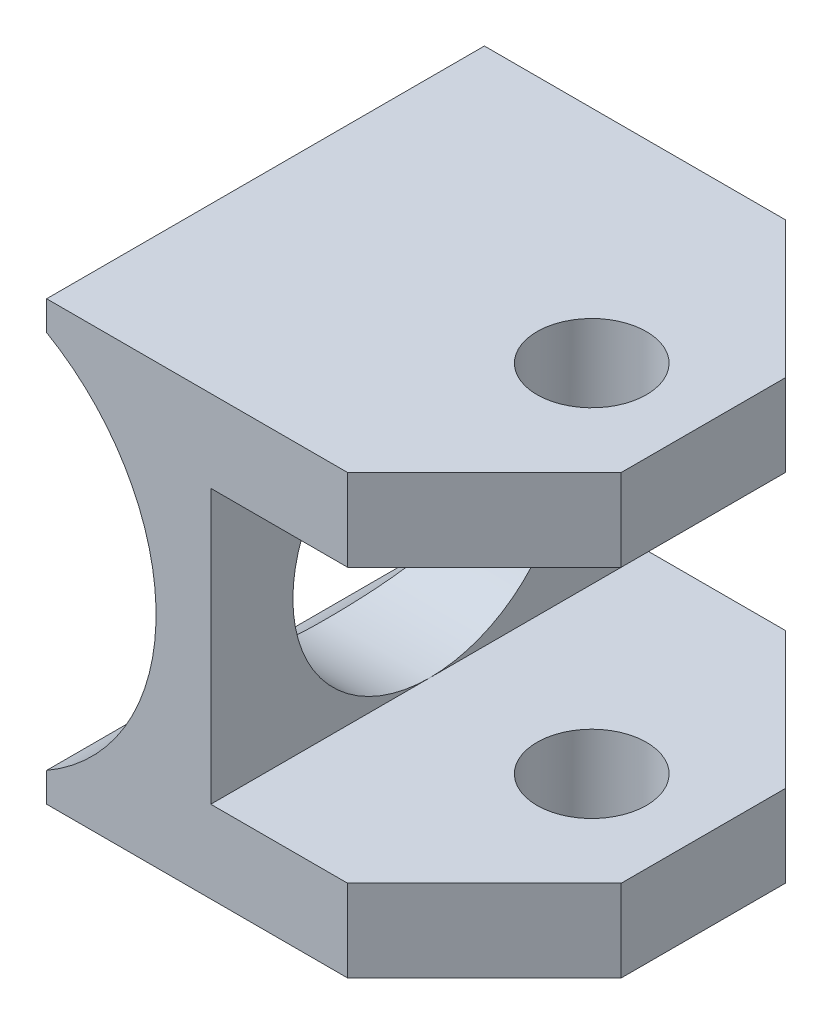
ISO-10303-21;
HEADER;
FILE_DESCRIPTION(('STEP AP214'),'2;1');
FILE_NAME('part.step','',(''),(''),'','','');
FILE_SCHEMA(('AUTOMOTIVE_DESIGN { 1 0 10303 214 1 1 1 1 }'));
ENDSEC;
DATA;
#1=APPLICATION_CONTEXT('core data for automotive mechanical design processes');
#2=APPLICATION_PROTOCOL_DEFINITION('international standard','automotive_design',2000,#1);
#3=PRODUCT_CONTEXT('',#1,'mechanical');
#4=PRODUCT('Part','Part','',(#3));
#5=PRODUCT_RELATED_PRODUCT_CATEGORY('part','',(#4));
#6=PRODUCT_DEFINITION_FORMATION('','',#4);
#7=PRODUCT_DEFINITION_CONTEXT('part definition',#1,'design');
#8=PRODUCT_DEFINITION('design','',#6,#7);
#9=PRODUCT_DEFINITION_SHAPE('','',#8);
#10=(LENGTH_UNIT() NAMED_UNIT(*) SI_UNIT(.MILLI.,.METRE.));
#11=(NAMED_UNIT(*) PLANE_ANGLE_UNIT() SI_UNIT($,.RADIAN.));
#12=(NAMED_UNIT(*) SI_UNIT($,.STERADIAN.) SOLID_ANGLE_UNIT());
#13=UNCERTAINTY_MEASURE_WITH_UNIT(LENGTH_MEASURE(1.E-05),#10,'distance_accuracy_value','');
#14=(GEOMETRIC_REPRESENTATION_CONTEXT(3) GLOBAL_UNCERTAINTY_ASSIGNED_CONTEXT((#13)) GLOBAL_UNIT_ASSIGNED_CONTEXT((#10,
#11,#12)) REPRESENTATION_CONTEXT('',''));
#15=CARTESIAN_POINT('',(0.,0.,0.));
#16=DIRECTION('',(0.,0.,1.));
#17=DIRECTION('',(1.,0.,0.));
#18=AXIS2_PLACEMENT_3D('',#15,#16,#17);
#19=CARTESIAN_POINT('',(15.875,7.9375,25.4));
#20=DIRECTION('',(-1.,0.,0.));
#21=DIRECTION('',(0.,-1.,0.));
#22=AXIS2_PLACEMENT_3D('',#19,#20,#21);
#23=PLANE('',#22);
#24=DIRECTION('',(0.,0.,-1.));
#25=VECTOR('',#24,1.);
#26=CARTESIAN_POINT('',(15.875,-7.9375,25.4));
#27=LINE('',#26,#25);
#28=CARTESIAN_POINT('',(15.875,-7.9375,25.4));
#29=VERTEX_POINT('',#28);
#30=CARTESIAN_POINT('',(15.875,-7.9375,12.7));
#31=VERTEX_POINT('',#30);
#32=EDGE_CURVE('E165',#29,#31,#27,.T.);
#33=ORIENTED_EDGE('',*,*,#32,.T.);
#34=CARTESIAN_POINT('',(15.875,0.,12.7));
#35=DIRECTION('',(1.,0.,0.));
#36=DIRECTION('',(0.,1.,0.));
#37=AXIS2_PLACEMENT_3D('',#34,#35,#36);
#38=CIRCLE('',#37,7.9375);
#39=CARTESIAN_POINT('',(15.875,7.9375,12.7));
#40=VERTEX_POINT('',#39);
#41=EDGE_CURVE('E58',#40,#31,#38,.T.);
#42=ORIENTED_EDGE('',*,*,#41,.F.);
#43=DIRECTION('',(0.,0.,-1.));
#44=VECTOR('',#43,1.);
#45=CARTESIAN_POINT('',(15.875,7.9375,25.4));
#46=LINE('',#45,#44);
#47=CARTESIAN_POINT('',(15.875,7.9375,25.4));
#48=VERTEX_POINT('',#47);
#49=EDGE_CURVE('E162',#48,#40,#46,.T.);
#50=ORIENTED_EDGE('',*,*,#49,.F.);
#51=DIRECTION('',(0.,1.,0.));
#52=VECTOR('',#51,1.);
#53=CARTESIAN_POINT('',(15.875,7.9375,25.4));
#54=LINE('',#53,#52);
#55=EDGE_CURVE('E238',#29,#48,#54,.T.);
#56=ORIENTED_EDGE('',*,*,#55,.F.);
#57=EDGE_LOOP('',(#33,#42,#50,#56));
#58=FACE_BOUND('',#57,.T.);
#59=ADVANCED_FACE('F38',(#58),#23,.F.);
#60=CARTESIAN_POINT('',(31.75,-7.9375,25.4));
#61=DIRECTION('',(0.,-1.,0.));
#62=DIRECTION('',(1.,0.,0.));
#63=AXIS2_PLACEMENT_3D('',#60,#61,#62);
#64=PLANE('',#63);
#65=CARTESIAN_POINT('',(25.4,-7.9375,12.8217741924015));
#66=DIRECTION('',(0.,-1.,0.));
#67=DIRECTION('',(1.,0.,0.));
#68=AXIS2_PLACEMENT_3D('',#65,#66,#67);
#69=CIRCLE('',#68,3.175);
#70=CARTESIAN_POINT('',(28.575,-7.9375,12.8217741924015));
#71=VERTEX_POINT('',#70);
#72=EDGE_CURVE('E188',#71,#71,#69,.T.);
#73=ORIENTED_EDGE('',*,*,#72,.T.);
#74=EDGE_LOOP('',(#73));
#75=FACE_BOUND('',#74,.T.);
#76=DIRECTION('',(0.,0.,-1.));
#77=VECTOR('',#76,1.);
#78=CARTESIAN_POINT('',(31.75,-7.9375,25.4));
#79=LINE('',#78,#77);
#80=CARTESIAN_POINT('',(31.75,-7.9375,17.4625));
#81=VERTEX_POINT('',#80);
#82=CARTESIAN_POINT('',(31.75,-7.9375,7.93750000000001));
#83=VERTEX_POINT('',#82);
#84=EDGE_CURVE('E247',#81,#83,#79,.T.);
#85=ORIENTED_EDGE('',*,*,#84,.T.);
#86=DIRECTION('',(0.707106781186548,0.,0.707106781186547));
#87=VECTOR('',#86,1.);
#88=CARTESIAN_POINT('',(31.75,-7.9375,7.93750000000001));
#89=LINE('',#88,#87);
#90=CARTESIAN_POINT('',(23.8125,-7.9375,0.));
#91=VERTEX_POINT('',#90);
#92=EDGE_CURVE('E213',#83,#91,#89,.F.);
#93=ORIENTED_EDGE('',*,*,#92,.T.);
#94=DIRECTION('',(-1.,0.,0.));
#95=VECTOR('',#94,1.);
#96=CARTESIAN_POINT('',(31.75,-7.9375,0.));
#97=LINE('',#96,#95);
#98=CARTESIAN_POINT('',(15.875,-7.9375,0.));
#99=VERTEX_POINT('',#98);
#100=EDGE_CURVE('E248',#91,#99,#97,.T.);
#101=ORIENTED_EDGE('',*,*,#100,.T.);
#102=EDGE_CURVE('E179',#31,#99,#27,.T.);
#103=ORIENTED_EDGE('',*,*,#102,.F.);
#104=ORIENTED_EDGE('',*,*,#32,.F.);
#105=DIRECTION('',(-1.,0.,0.));
#106=VECTOR('',#105,1.);
#107=CARTESIAN_POINT('',(31.75,-7.9375,25.4));
#108=LINE('',#107,#106);
#109=CARTESIAN_POINT('',(23.8125,-7.9375,25.4));
#110=VERTEX_POINT('',#109);
#111=EDGE_CURVE('E265',#110,#29,#108,.T.);
#112=ORIENTED_EDGE('',*,*,#111,.F.);
#113=DIRECTION('',(0.707106781186546,0.,-0.707106781186549));
#114=VECTOR('',#113,1.);
#115=CARTESIAN_POINT('',(23.8125,-7.9375,25.4));
#116=LINE('',#115,#114);
#117=EDGE_CURVE('E211',#110,#81,#116,.T.);
#118=ORIENTED_EDGE('',*,*,#117,.T.);
#119=EDGE_LOOP('',(#85,#93,#101,#103,#104,#112,#118));
#120=FACE_BOUND('',#119,.T.);
#121=ADVANCED_FACE('F325',(#75,#120),#64,.F.);
#122=CARTESIAN_POINT('',(15.875,7.9375,0.));
#123=VERTEX_POINT('',#122);
#124=EDGE_CURVE('E167',#40,#123,#46,.T.);
#125=ORIENTED_EDGE('',*,*,#124,.F.);
#126=EDGE_CURVE('E150',#31,#40,#38,.T.);
#127=ORIENTED_EDGE('',*,*,#126,.F.);
#128=ORIENTED_EDGE('',*,*,#102,.T.);
#129=DIRECTION('',(0.,1.,0.));
#130=VECTOR('',#129,1.);
#131=CARTESIAN_POINT('',(15.875,7.9375,0.));
#132=LINE('',#131,#130);
#133=EDGE_CURVE('E170',#99,#123,#132,.T.);
#134=ORIENTED_EDGE('',*,*,#133,.T.);
#135=EDGE_LOOP('',(#125,#127,#128,#134));
#136=FACE_BOUND('',#135,.T.);
#137=ADVANCED_FACE('F168',(#136),#23,.F.);
#138=CARTESIAN_POINT('',(31.75,7.9375,25.4));
#139=DIRECTION('',(0.,1.,0.));
#140=DIRECTION('',(-1.,0.,0.));
#141=AXIS2_PLACEMENT_3D('',#138,#139,#140);
#142=PLANE('',#141);
#143=CARTESIAN_POINT('',(25.4,7.9375,12.8217741924015));
#144=DIRECTION('',(0.,1.,0.));
#145=DIRECTION('',(-1.,0.,0.));
#146=AXIS2_PLACEMENT_3D('',#143,#144,#145);
#147=CIRCLE('',#146,3.175);
#148=CARTESIAN_POINT('',(22.225,7.9375,12.8217741924015));
#149=VERTEX_POINT('',#148);
#150=EDGE_CURVE('E185',#149,#149,#147,.T.);
#151=ORIENTED_EDGE('',*,*,#150,.T.);
#152=EDGE_LOOP('',(#151));
#153=FACE_BOUND('',#152,.T.);
#154=DIRECTION('',(1.,0.,0.));
#155=VECTOR('',#154,1.);
#156=CARTESIAN_POINT('',(31.75,7.9375,0.));
#157=LINE('',#156,#155);
#158=CARTESIAN_POINT('',(23.8125,7.9375,0.));
#159=VERTEX_POINT('',#158);
#160=EDGE_CURVE('E252',#123,#159,#157,.T.);
#161=ORIENTED_EDGE('',*,*,#160,.T.);
#162=DIRECTION('',(-0.707106781186548,0.,-0.707106781186547));
#163=VECTOR('',#162,1.);
#164=CARTESIAN_POINT('',(31.75,7.9375,7.93750000000001));
#165=LINE('',#164,#163);
#166=CARTESIAN_POINT('',(31.75,7.9375,7.93750000000001));
#167=VERTEX_POINT('',#166);
#168=EDGE_CURVE('E204',#159,#167,#165,.F.);
#169=ORIENTED_EDGE('',*,*,#168,.T.);
#170=DIRECTION('',(0.,0.,-1.));
#171=VECTOR('',#170,1.);
#172=CARTESIAN_POINT('',(31.75,7.9375,25.4));
#173=LINE('',#172,#171);
#174=CARTESIAN_POINT('',(31.75,7.9375,17.4625));
#175=VERTEX_POINT('',#174);
#176=EDGE_CURVE('E174',#175,#167,#173,.T.);
#177=ORIENTED_EDGE('',*,*,#176,.F.);
#178=DIRECTION('',(-0.707106781186546,0.,0.707106781186549));
#179=VECTOR('',#178,1.);
#180=CARTESIAN_POINT('',(23.8125,7.9375,25.4));
#181=LINE('',#180,#179);
#182=CARTESIAN_POINT('',(23.8125,7.9375,25.4));
#183=VERTEX_POINT('',#182);
#184=EDGE_CURVE('E202',#175,#183,#181,.T.);
#185=ORIENTED_EDGE('',*,*,#184,.T.);
#186=DIRECTION('',(1.,0.,0.));
#187=VECTOR('',#186,1.);
#188=CARTESIAN_POINT('',(31.75,7.9375,25.4));
#189=LINE('',#188,#187);
#190=EDGE_CURVE('E178',#48,#183,#189,.T.);
#191=ORIENTED_EDGE('',*,*,#190,.F.);
#192=ORIENTED_EDGE('',*,*,#49,.T.);
#193=ORIENTED_EDGE('',*,*,#124,.T.);
#194=EDGE_LOOP('',(#161,#169,#177,#185,#191,#192,#193));
#195=FACE_BOUND('',#194,.T.);
#196=ADVANCED_FACE('F176',(#153,#195),#142,.F.);
#197=CARTESIAN_POINT('',(31.75,12.7,25.4));
#198=DIRECTION('',(-1.,0.,0.));
#199=DIRECTION('',(0.,0.,1.));
#200=AXIS2_PLACEMENT_3D('',#197,#198,#199);
#201=PLANE('',#200);
#202=ORIENTED_EDGE('',*,*,#176,.T.);
#203=DIRECTION('',(0.,1.,0.));
#204=VECTOR('',#203,1.);
#205=CARTESIAN_POINT('',(31.75,12.7,7.93750000000001));
#206=LINE('',#205,#204);
#207=CARTESIAN_POINT('',(31.75,12.7,7.93750000000001));
#208=VERTEX_POINT('',#207);
#209=EDGE_CURVE('E191',#167,#208,#206,.T.);
#210=ORIENTED_EDGE('',*,*,#209,.T.);
#211=DIRECTION('',(0.,0.,-1.));
#212=VECTOR('',#211,1.);
#213=CARTESIAN_POINT('',(31.75,12.7,25.4));
#214=LINE('',#213,#212);
#215=CARTESIAN_POINT('',(31.75,12.7,17.4625));
#216=VERTEX_POINT('',#215);
#217=EDGE_CURVE('E280',#216,#208,#214,.T.);
#218=ORIENTED_EDGE('',*,*,#217,.F.);
#219=DIRECTION('',(0.,-1.,0.));
#220=VECTOR('',#219,1.);
#221=CARTESIAN_POINT('',(31.75,7.9375,17.4625));
#222=LINE('',#221,#220);
#223=EDGE_CURVE('E184',#216,#175,#222,.T.);
#224=ORIENTED_EDGE('',*,*,#223,.T.);
#225=EDGE_LOOP('',(#202,#210,#218,#224));
#226=FACE_BOUND('',#225,.T.);
#227=ADVANCED_FACE('F285',(#226),#201,.F.);
#228=CARTESIAN_POINT('',(6.35,12.7,25.4));
#229=DIRECTION('',(0.,-1.,0.));
#230=DIRECTION('',(0.,0.,-1.));
#231=AXIS2_PLACEMENT_3D('',#228,#229,#230);
#232=PLANE('',#231);
#233=CARTESIAN_POINT('',(25.4,12.7,12.8217741924015));
#234=DIRECTION('',(0.,1.,0.));
#235=DIRECTION('',(0.,0.,1.));
#236=AXIS2_PLACEMENT_3D('',#233,#234,#235);
#237=CIRCLE('',#236,3.175);
#238=CARTESIAN_POINT('',(25.4,12.7,15.9967741924015));
#239=VERTEX_POINT('',#238);
#240=EDGE_CURVE('E354',#239,#239,#237,.T.);
#241=ORIENTED_EDGE('',*,*,#240,.F.);
#242=EDGE_LOOP('',(#241));
#243=FACE_BOUND('',#242,.T.);
#244=ORIENTED_EDGE('',*,*,#217,.T.);
#245=DIRECTION('',(0.707106781186548,0.,0.707106781186547));
#246=VECTOR('',#245,1.);
#247=CARTESIAN_POINT('',(31.75,12.7,7.93750000000001));
#248=LINE('',#247,#246);
#249=CARTESIAN_POINT('',(23.8125,12.7,0.));
#250=VERTEX_POINT('',#249);
#251=EDGE_CURVE('E196',#208,#250,#248,.F.);
#252=ORIENTED_EDGE('',*,*,#251,.T.);
#253=DIRECTION('',(-1.,0.,0.));
#254=VECTOR('',#253,1.);
#255=CARTESIAN_POINT('',(6.35,12.7,0.));
#256=LINE('',#255,#254);
#257=CARTESIAN_POINT('',(6.35,12.7,0.));
#258=VERTEX_POINT('',#257);
#259=EDGE_CURVE('E254',#250,#258,#256,.T.);
#260=ORIENTED_EDGE('',*,*,#259,.T.);
#261=DIRECTION('',(0.,0.,-1.));
#262=VECTOR('',#261,1.);
#263=CARTESIAN_POINT('',(6.35,12.7,25.4));
#264=LINE('',#263,#262);
#265=CARTESIAN_POINT('',(6.35,12.7,25.4));
#266=VERTEX_POINT('',#265);
#267=EDGE_CURVE('E232',#266,#258,#264,.T.);
#268=ORIENTED_EDGE('',*,*,#267,.F.);
#269=DIRECTION('',(-1.,0.,0.));
#270=VECTOR('',#269,1.);
#271=CARTESIAN_POINT('',(6.35,12.7,25.4));
#272=LINE('',#271,#270);
#273=CARTESIAN_POINT('',(23.8125,12.7,25.4));
#274=VERTEX_POINT('',#273);
#275=EDGE_CURVE('E223',#274,#266,#272,.T.);
#276=ORIENTED_EDGE('',*,*,#275,.F.);
#277=DIRECTION('',(0.707106781186546,0.,-0.707106781186549));
#278=VECTOR('',#277,1.);
#279=CARTESIAN_POINT('',(23.8125,12.7,25.4));
#280=LINE('',#279,#278);
#281=EDGE_CURVE('E194',#274,#216,#280,.T.);
#282=ORIENTED_EDGE('',*,*,#281,.T.);
#283=EDGE_LOOP('',(#244,#252,#260,#268,#276,#282));
#284=FACE_BOUND('',#283,.T.);
#285=ADVANCED_FACE('F229',(#243,#284),#232,.F.);
#286=CARTESIAN_POINT('',(6.35,12.7,25.4));
#287=DIRECTION('',(1.,0.,0.));
#288=DIRECTION('',(0.,0.,-1.));
#289=AXIS2_PLACEMENT_3D('',#286,#287,#288);
#290=PLANE('',#289);
#291=DIRECTION('',(0.,-1.,0.));
#292=VECTOR('',#291,1.);
#293=CARTESIAN_POINT('',(6.35,12.7,0.));
#294=LINE('',#293,#292);
#295=CARTESIAN_POINT('',(6.35,10.9985226280624,0.));
#296=VERTEX_POINT('',#295);
#297=EDGE_CURVE('E256',#258,#296,#294,.T.);
#298=ORIENTED_EDGE('',*,*,#297,.T.);
#299=DIRECTION('',(0.,0.,-1.));
#300=VECTOR('',#299,1.);
#301=CARTESIAN_POINT('',(6.35,10.9985226280624,25.4));
#302=LINE('',#301,#300);
#303=CARTESIAN_POINT('',(6.35,10.9985226280624,25.4));
#304=VERTEX_POINT('',#303);
#305=EDGE_CURVE('E277',#304,#296,#302,.T.);
#306=ORIENTED_EDGE('',*,*,#305,.F.);
#307=DIRECTION('',(0.,-1.,0.));
#308=VECTOR('',#307,1.);
#309=CARTESIAN_POINT('',(6.35,12.7,25.4));
#310=LINE('',#309,#308);
#311=EDGE_CURVE('E234',#266,#304,#310,.T.);
#312=ORIENTED_EDGE('',*,*,#311,.F.);
#313=ORIENTED_EDGE('',*,*,#267,.T.);
#314=EDGE_LOOP('',(#298,#306,#312,#313));
#315=FACE_BOUND('',#314,.T.);
#316=ADVANCED_FACE('F299',(#315),#290,.F.);
#317=CARTESIAN_POINT('',(0.,0.,25.4));
#318=DIRECTION('',(0.,0.,-1.));
#319=DIRECTION('',(-1.,0.,0.));
#320=AXIS2_PLACEMENT_3D('',#317,#318,#319);
#321=CYLINDRICAL_SURFACE('',#320,12.7);
#322=CARTESIAN_POINT('',(9.91393432245746,7.93749999999999,12.7));
#323=CARTESIAN_POINT('',(9.91393743092308,7.93749807117173,12.8973419473668));
#324=CARTESIAN_POINT('',(9.91985215824847,7.93012603335574,13.0947215209105));
#325=CARTESIAN_POINT('',(9.94324673536641,7.90077104762888,13.4877854127054));
#326=CARTESIAN_POINT('',(9.96073339680289,7.87877949412646,13.6834686636694));
#327=CARTESIAN_POINT('',(10.0065324338063,7.82052925594829,14.0718083760823));
#328=CARTESIAN_POINT('',(10.0348666437677,7.78424179156469,14.2644579115298));
#329=CARTESIAN_POINT('',(10.101195001923,7.69797450385109,14.645043990796));
#330=CARTESIAN_POINT('',(10.1391939786885,7.64798783535172,14.8329781270604));
#331=CARTESIAN_POINT('',(10.2230420608463,7.53553428680958,15.2012730518735));
#332=CARTESIAN_POINT('',(10.2688158617562,7.47318624722427,15.3816875444356));
#333=CARTESIAN_POINT('',(10.3670018650817,7.33637238040691,15.7360566142668));
#334=CARTESIAN_POINT('',(10.4194165927314,7.26190194050868,15.9100087014738));
#335=CARTESIAN_POINT('',(10.5293900056247,7.10150650275365,16.2507695742633));
#336=CARTESIAN_POINT('',(10.5869470535524,7.01558514661686,16.4175806087131));
#337=CARTESIAN_POINT('',(10.7058168021436,6.8328157497932,16.7436961942778));
#338=CARTESIAN_POINT('',(10.7671296214479,6.7359673638515,16.9030005079817));
#339=CARTESIAN_POINT('',(10.9005856580608,6.51810262210699,17.2346122324182));
#340=CARTESIAN_POINT('',(10.9730780959916,6.39558712833621,17.4057956613673));
#341=CARTESIAN_POINT('',(11.1193961406205,6.13767190932958,17.7375632510214));
#342=CARTESIAN_POINT('',(11.1932218447478,6.00227123938997,17.8981466330976));
#343=CARTESIAN_POINT('',(11.3405793525838,5.71898311367739,18.2082916826293));
#344=CARTESIAN_POINT('',(11.4141108977764,5.57108647346249,18.3578450892493));
#345=CARTESIAN_POINT('',(11.5592442814053,5.26334714419427,18.6452007689191));
#346=CARTESIAN_POINT('',(11.6308457432919,5.10350214670036,18.7830007601235));
#347=CARTESIAN_POINT('',(11.7790512355257,4.75231816673879,19.062041829267));
#348=CARTESIAN_POINT('',(11.8552106939563,4.55950961778765,19.2016779504539));
#349=CARTESIAN_POINT('',(12.0010624927184,4.16048061480433,19.4639692392614));
#350=CARTESIAN_POINT('',(12.0707577505083,3.9542662833262,19.586632079773));
#351=CARTESIAN_POINT('',(12.2017054249088,3.52955168731285,19.8136569756096));
#352=CARTESIAN_POINT('',(12.2629618345875,3.31105730280366,19.918027692753));
#353=CARTESIAN_POINT('',(12.3751940579834,2.86318550306455,20.1070996839522));
#354=CARTESIAN_POINT('',(12.4261717410597,2.63381007612534,20.1918045350015));
#355=CARTESIAN_POINT('',(12.5116072321274,2.18985682334513,20.3326287607597));
#356=CARTESIAN_POINT('',(12.5472173985435,1.97614412570738,20.3907783430431));
#357=CARTESIAN_POINT('',(12.6077929385108,1.54315338166047,20.4892142298474));
#358=CARTESIAN_POINT('',(12.632758967362,1.32387567873837,20.5295016340485));
#359=CARTESIAN_POINT('',(12.6712823156172,0.881910980169238,20.5915075654516));
#360=CARTESIAN_POINT('',(12.6848496264323,0.659227144852406,20.6132423549958));
#361=CARTESIAN_POINT('',(12.700189771581,0.212423453759177,20.637809668065));
#362=CARTESIAN_POINT('',(12.7019639634905,-0.011696233754465,20.6406443672919));
#363=CARTESIAN_POINT('',(12.6942296634621,-0.429035223888257,20.6282648350536));
#364=CARTESIAN_POINT('',(12.6862058663109,-0.62235823312776,20.6154257355186));
#365=CARTESIAN_POINT('',(12.6614801835746,-1.00700112464608,20.575736763912));
#366=CARTESIAN_POINT('',(12.6447783901897,-1.19832102818506,20.5488870406977));
#367=CARTESIAN_POINT('',(12.6030772135313,-1.57760898199506,20.4815268240343));
#368=CARTESIAN_POINT('',(12.5780779198634,-1.76557706843963,20.4410164781077));
#369=CARTESIAN_POINT('',(12.5203318918918,-2.13696376055922,20.3468293775869));
#370=CARTESIAN_POINT('',(12.4875848313309,-2.32038217428876,20.2931520685303));
#371=CARTESIAN_POINT('',(12.4149421348142,-2.68203232637647,20.1730841675945));
#372=CARTESIAN_POINT('',(12.3750303286643,-2.86025124976266,20.1066647942266));
#373=CARTESIAN_POINT('',(12.288903070966,-3.21020089927347,19.9618469139278));
#374=CARTESIAN_POINT('',(12.2426855288447,-3.3819294493971,19.8834444331348));
#375=CARTESIAN_POINT('',(12.095872474436,-3.88614684054671,19.6312926139097));
#376=CARTESIAN_POINT('',(11.9870644777299,-4.20791741807511,19.4405148403145));
#377=CARTESIAN_POINT('',(11.7407146973701,-4.8559779367887,18.9926593049406));
#378=CARTESIAN_POINT('',(11.6012821960077,-5.1778470367181,18.7302852986395));
#379=CARTESIAN_POINT('',(11.3153894233701,-5.77597246713827,18.160122153886));
#380=CARTESIAN_POINT('',(11.1689191509646,-6.05216125105313,17.85226701367));
#381=CARTESIAN_POINT('',(10.9442052242841,-6.44525099752128,17.3386711320003));
#382=CARTESIAN_POINT('',(10.863953416429,-6.57924242421982,17.1466373385129));
#383=CARTESIAN_POINT('',(10.7077668255894,-6.83048858697236,16.7501114043343));
#384=CARTESIAN_POINT('',(10.6318328552849,-6.94774017857745,16.5456169332671));
#385=CARTESIAN_POINT('',(10.4871369448416,-7.16428003695993,16.1253190811957));
#386=CARTESIAN_POINT('',(10.4183644230893,-7.26359497075574,15.9095331140881));
#387=CARTESIAN_POINT('',(10.2907680692678,-7.4432684407942,15.4674053699895));
#388=CARTESIAN_POINT('',(10.2319399940845,-7.52363506774175,15.2410681478863));
#389=CARTESIAN_POINT('',(10.1409356021058,-7.64562571774624,14.840082345974));
#390=CARTESIAN_POINT('',(10.1058190992332,-7.69188004525148,14.6674974829339));
#391=CARTESIAN_POINT('',(10.0436676197095,-7.77286000991658,14.3182297843453));
#392=CARTESIAN_POINT('',(10.0166306889123,-7.80758843498593,14.1415479508588));
#393=CARTESIAN_POINT('',(9.97159914754477,-7.86502040955978,13.7852993043909));
#394=CARTESIAN_POINT('',(9.9535943493274,-7.88773750861337,13.6057359786318));
#395=CARTESIAN_POINT('',(9.92725853225642,-7.92085789749513,13.2447592078086));
#396=CARTESIAN_POINT('',(9.91892766668002,-7.93126099221591,13.0633457334762));
#397=CARTESIAN_POINT('',(9.91226303596064,-7.93958886915166,12.699627886823));
#398=CARTESIAN_POINT('',(9.91395234775775,-7.93748484686335,12.5173224248947));
#399=CARTESIAN_POINT('',(9.92731384781059,-7.92076713027602,12.1536582134984));
#400=CARTESIAN_POINT('',(9.93898609289779,-7.90615336476078,11.9722994694258));
#401=CARTESIAN_POINT('',(9.97186350946095,-7.86464458928345,11.6117828822214));
#402=CARTESIAN_POINT('',(9.99307362080675,-7.83774321518591,11.4326262290601));
#403=CARTESIAN_POINT('',(10.0442534502941,-7.77204614469582,11.0777196131951));
#404=CARTESIAN_POINT('',(10.0742267851106,-7.73324553703941,10.9019710890601));
#405=CARTESIAN_POINT('',(10.1413407941711,-7.64501277058946,10.5578759134273));
#406=CARTESIAN_POINT('',(10.1783507843565,-7.59577281991966,10.3894541906629));
#407=CARTESIAN_POINT('',(10.2587766080083,-7.48679406868883,10.0575869903785));
#408=CARTESIAN_POINT('',(10.3021945286435,-7.42705184614786,9.89414315524309));
#409=CARTESIAN_POINT('',(10.4403538304839,-7.23285940874745,9.41220711452345));
#410=CARTESIAN_POINT('',(10.5430357226203,-7.08339933513072,9.10194110865951));
#411=CARTESIAN_POINT('',(10.781510951545,-6.71606056449941,8.4498234680742));
#412=CARTESIAN_POINT('',(10.9198863364876,-6.49057334557518,8.11320473830511));
#413=CARTESIAN_POINT('',(11.1306963245213,-6.11704111107704,7.63774622437057));
#414=CARTESIAN_POINT('',(11.2015652952635,-5.98652858081219,7.48406086270945));
#415=CARTESIAN_POINT('',(11.3429763006025,-5.71405449107206,7.18691398237368));
#416=CARTESIAN_POINT('',(11.4135182725577,-5.57209082661585,7.04345435259447));
#417=CARTESIAN_POINT('',(11.5640372459169,-5.2534636765396,6.74516975727459));
#418=CARTESIAN_POINT('',(11.6437082552696,-5.07489047419139,6.59222444225079));
#419=CARTESIAN_POINT('',(11.7985367210445,-4.70371630182141,6.30199791161703));
#420=CARTESIAN_POINT('',(11.8736958712464,-4.51112065675944,6.16471080018115));
#421=CARTESIAN_POINT('',(12.0175099931568,-4.11269997828182,5.90692310882832));
#422=CARTESIAN_POINT('',(12.0861652819097,-3.9068755905506,5.78642171052195));
#423=CARTESIAN_POINT('',(12.215028128029,-3.48311756629154,5.56353821312848));
#424=CARTESIAN_POINT('',(12.2752367509349,-3.26518546199252,5.46115382816924));
#425=CARTESIAN_POINT('',(12.3821073364553,-2.83199177980674,5.28141588628359));
#426=CARTESIAN_POINT('',(12.4293629720927,-2.61734576396781,5.20293385002475));
#427=CARTESIAN_POINT('',(12.5134440839727,-2.18019278875926,5.06434501873419));
#428=CARTESIAN_POINT('',(12.5502698053864,-1.95768601430726,5.00423779177151));
#429=CARTESIAN_POINT('',(12.6123219175109,-1.50698970812904,4.90345291578128));
#430=CARTESIAN_POINT('',(12.6375616318848,-1.27880702366645,4.86275294671762));
#431=CARTESIAN_POINT('',(12.6756810572711,-0.818749786145594,4.80143183963765));
#432=CARTESIAN_POINT('',(12.688562812949,-0.586875850273308,4.78080738005311));
#433=CARTESIAN_POINT('',(12.7005867596475,-0.156261293647302,4.76155892461821));
#434=CARTESIAN_POINT('',(12.70147806193,0.0423118825154984,4.76013411291166));
#435=CARTESIAN_POINT('',(12.6939644931375,0.438829919383832,4.77215881998338));
#436=CARTESIAN_POINT('',(12.685560050359,0.636774808615952,4.78560765346638));
#437=CARTESIAN_POINT('',(12.6596609571081,1.03049004439692,4.82718699179976));
#438=CARTESIAN_POINT('',(12.6421670478776,1.22626056693495,4.85531629946479));
#439=CARTESIAN_POINT('',(12.598507705164,1.61422143641658,4.92587174223497));
#440=CARTESIAN_POINT('',(12.5723420911155,1.80641170872293,4.96829817504016));
#441=CARTESIAN_POINT('',(12.5129997291544,2.17927146967088,5.06517973090754));
#442=CARTESIAN_POINT('',(12.4801004774043,2.36010874093628,5.11916178651719));
#443=CARTESIAN_POINT('',(12.4074472588691,2.71630413457792,5.23937361310624));
#444=CARTESIAN_POINT('',(12.3676910756804,2.89166046360292,5.30560734476566));
#445=CARTESIAN_POINT('',(12.2821039617717,3.23594956191219,5.4496659460595));
#446=CARTESIAN_POINT('',(12.2362747015826,3.40488408126802,5.52748762890358));
#447=CARTESIAN_POINT('',(12.1393647800458,3.73571812716443,5.69409831573719));
#448=CARTESIAN_POINT('',(12.0882822147684,3.89761507265321,5.78289129836725));
#449=CARTESIAN_POINT('',(11.9174367352839,4.40453137082998,6.08422041738119));
#450=CARTESIAN_POINT('',(11.789125336336,4.73498961253622,6.3168741254543));
#451=CARTESIAN_POINT('',(11.5210034521921,5.35450474789467,6.82679162091428));
#452=CARTESIAN_POINT('',(11.38118007982,5.64351422152492,7.10410574499164));
#453=CARTESIAN_POINT('',(11.1609311335306,6.06245469084998,7.57138443198061));
#454=CARTESIAN_POINT('',(11.0806664160962,6.20757371147303,7.74801049072365));
#455=CARTESIAN_POINT('',(10.9221411305204,6.48244047607236,8.11368961161338));
#456=CARTESIAN_POINT('',(10.8438809280521,6.61218543087358,8.3027449190405));
#457=CARTESIAN_POINT('',(10.6156799834555,6.97705598554874,8.88746806028404));
#458=CARTESIAN_POINT('',(10.4720667600113,7.18827539875168,9.30120253140835));
#459=CARTESIAN_POINT('',(10.2507773072005,7.49932946637276,10.0737985118251));
#460=CARTESIAN_POINT('',(10.1655461083059,7.61344381460759,10.4247206322575));
#461=CARTESIAN_POINT('',(10.0631440576819,7.74765800298494,10.9644717705398));
#462=CARTESIAN_POINT('',(10.0332681346926,7.78621624163261,11.1464271212424));
#463=CARTESIAN_POINT('',(9.98298925565334,7.85058138682066,11.5138311056077));
#464=CARTESIAN_POINT('',(9.96258142541109,7.87639485483383,11.6992778905913));
#465=CARTESIAN_POINT('',(9.93626716627901,7.90954454493815,12.0207163673922));
#466=CARTESIAN_POINT('',(9.9279108380348,7.92001686347467,12.1561965252872));
#467=CARTESIAN_POINT('',(9.91674264691122,7.9339961320438,12.427778389774));
#468=CARTESIAN_POINT('',(9.91393217834371,7.93750133044005,12.5638802440509));
#469=CARTESIAN_POINT('',(9.91393432245746,7.93749999999999,12.7));
#470=B_SPLINE_CURVE_WITH_KNOTS('',3,(#322,#323,#324,#325,#326,#327,#328,#329,#330,#331,#332,
#333,#334,#335,#336,#337,#338,#339,#340,#341,#342,#343,#344,#345,#346,#347,#348,#349,#350,#351,
#352,#353,#354,#355,#356,#357,#358,#359,#360,#361,#362,#363,#364,#365,#366,#367,#368,#369,#370,
#371,#372,#373,#374,#375,#376,#377,#378,#379,#380,#381,#382,#383,#384,#385,#386,#387,#388,#389,
#390,#391,#392,#393,#394,#395,#396,#397,#398,#399,#400,#401,#402,#403,#404,#405,#406,#407,#408,
#409,#410,#411,#412,#413,#414,#415,#416,#417,#418,#419,#420,#421,#422,#423,#424,#425,#426,#427,
#428,#429,#430,#431,#432,#433,#434,#435,#436,#437,#438,#439,#440,#441,#442,#443,#444,#445,#446,
#447,#448,#449,#450,#451,#452,#453,#454,#455,#456,#457,#458,#459,#460,#461,#462,#463,#464,#465,
#466,#467,#468,#469),.UNSPECIFIED.,.T.,.F.,(4,2,2,2,2,2,2,2,2,2,2,2,2,2,2,2,2,2,2,2,2,2,2,2,2,2,
2,2,2,2,2,2,2,2,2,2,2,2,2,2,2,2,2,2,2,2,2,2,2,2,2,2,2,2,2,2,2,2,2,2,2,2,2,2,2,2,2,2,2,2,2,2,2,
4),(0.,0.591868627851358,1.18408596048253,1.77750165380366,2.37121440529117,2.95947423182983,
3.54795842122594,4.13625590039149,4.72457197284976,5.39183974714808,6.05915648133166,
6.72696802742672,7.39490893086401,8.14375547254982,8.89226237916849,9.64041388408815,
10.3884292021125,11.06042681852,11.7323830578222,12.4037496855178,13.0750390268694,
13.6560853409466,14.2371254817675,14.8181593480741,15.3992176859833,15.9816042967208,
16.5641844604029,17.7285465780936,19.0378098157476,20.3489920539132,21.090817692213,
21.8327824939127,22.5736349446533,23.3141704848642,23.8599197831255,24.405536978029,
24.9505373613146,25.4955463796607,26.0418110660364,26.5880788622416,27.134629908943,
27.68140684223,28.2188767470207,28.7565221025905,29.8312827257654,31.1106653030828,
31.7513794571451,32.392211658741,33.1360493525192,33.8796060359229,34.6231264544351,
35.3665529939868,36.0656523145943,36.7647352004268,37.4630121292216,38.1611735058357,
38.7561604440118,39.3511199696233,39.9460309841615,40.5409543869227,41.1150518645325,
41.6893352598014,42.2634610126861,42.8377955814166,44.1046058539166,45.3728540698994,
46.0989299661152,46.8251373865625,48.2753879889853,49.4067352744844,49.9712745352798,
50.5355228468086,50.9436710721342,51.3519218989456),.UNSPECIFIED.);
#471=CARTESIAN_POINT('',(9.91393432245746,7.93749999999999,12.7));
#472=VERTEX_POINT('',#471);
#473=EDGE_CURVE('E42',#472,#472,#470,.T.);
#474=ORIENTED_EDGE('',*,*,#473,.T.);
#475=EDGE_LOOP('',(#474));
#476=FACE_BOUND('',#475,.T.);
#477=CARTESIAN_POINT('',(0.,0.,0.));
#478=DIRECTION('',(0.,0.,-1.));
#479=DIRECTION('',(1.,0.,0.));
#480=AXIS2_PLACEMENT_3D('',#477,#478,#479);
#481=CIRCLE('',#480,12.7);
#482=CARTESIAN_POINT('',(6.34999999999999,-10.9985226280624,0.));
#483=VERTEX_POINT('',#482);
#484=EDGE_CURVE('E258',#296,#483,#481,.T.);
#485=ORIENTED_EDGE('',*,*,#484,.T.);
#486=DIRECTION('',(0.,0.,-1.));
#487=VECTOR('',#486,1.);
#488=CARTESIAN_POINT('',(6.34999999999999,-10.9985226280624,25.4));
#489=LINE('',#488,#487);
#490=CARTESIAN_POINT('',(6.34999999999999,-10.9985226280624,25.4));
#491=VERTEX_POINT('',#490);
#492=EDGE_CURVE('E274',#491,#483,#489,.T.);
#493=ORIENTED_EDGE('',*,*,#492,.F.);
#494=CARTESIAN_POINT('',(0.,0.,25.4));
#495=DIRECTION('',(0.,0.,-1.));
#496=DIRECTION('',(1.,0.,0.));
#497=AXIS2_PLACEMENT_3D('',#494,#495,#496);
#498=CIRCLE('',#497,12.7);
#499=EDGE_CURVE('E236',#304,#491,#498,.T.);
#500=ORIENTED_EDGE('',*,*,#499,.F.);
#501=ORIENTED_EDGE('',*,*,#305,.T.);
#502=EDGE_LOOP('',(#485,#493,#500,#501));
#503=FACE_BOUND('',#502,.T.);
#504=ADVANCED_FACE('F302',(#476,#503),#321,.F.);
#505=CARTESIAN_POINT('',(6.34999999999999,-12.7,25.4));
#506=DIRECTION('',(1.,0.,0.));
#507=DIRECTION('',(0.,0.,-1.));
#508=AXIS2_PLACEMENT_3D('',#505,#506,#507);
#509=PLANE('',#508);
#510=DIRECTION('',(0.,-1.,0.));
#511=VECTOR('',#510,1.);
#512=CARTESIAN_POINT('',(6.34999999999999,-12.7,0.));
#513=LINE('',#512,#511);
#514=CARTESIAN_POINT('',(6.34999999999999,-12.7,0.));
#515=VERTEX_POINT('',#514);
#516=EDGE_CURVE('E260',#483,#515,#513,.T.);
#517=ORIENTED_EDGE('',*,*,#516,.T.);
#518=DIRECTION('',(0.,0.,-1.));
#519=VECTOR('',#518,1.);
#520=CARTESIAN_POINT('',(6.34999999999999,-12.7,25.4));
#521=LINE('',#520,#519);
#522=CARTESIAN_POINT('',(6.34999999999999,-12.7,25.4));
#523=VERTEX_POINT('',#522);
#524=EDGE_CURVE('E271',#523,#515,#521,.T.);
#525=ORIENTED_EDGE('',*,*,#524,.F.);
#526=DIRECTION('',(0.,-1.,0.));
#527=VECTOR('',#526,1.);
#528=CARTESIAN_POINT('',(6.34999999999999,-12.7,25.4));
#529=LINE('',#528,#527);
#530=EDGE_CURVE('E243',#491,#523,#529,.T.);
#531=ORIENTED_EDGE('',*,*,#530,.F.);
#532=ORIENTED_EDGE('',*,*,#492,.T.);
#533=EDGE_LOOP('',(#517,#525,#531,#532));
#534=FACE_BOUND('',#533,.T.);
#535=ADVANCED_FACE('F308',(#534),#509,.F.);
#536=CARTESIAN_POINT('',(6.34999999999999,-12.7,25.4));
#537=DIRECTION('',(0.,1.,0.));
#538=DIRECTION('',(0.,0.,1.));
#539=AXIS2_PLACEMENT_3D('',#536,#537,#538);
#540=PLANE('',#539);
#541=CARTESIAN_POINT('',(25.4,-12.7,12.8217741924015));
#542=DIRECTION('',(0.,1.,0.));
#543=DIRECTION('',(0.,0.,1.));
#544=AXIS2_PLACEMENT_3D('',#541,#542,#543);
#545=CIRCLE('',#544,3.17499999999999);
#546=CARTESIAN_POINT('',(25.4,-12.7,15.9967741924015));
#547=VERTEX_POINT('',#546);
#548=EDGE_CURVE('E189',#547,#547,#545,.T.);
#549=ORIENTED_EDGE('',*,*,#548,.T.);
#550=EDGE_LOOP('',(#549));
#551=FACE_BOUND('',#550,.T.);
#552=DIRECTION('',(1.,0.,0.));
#553=VECTOR('',#552,1.);
#554=CARTESIAN_POINT('',(6.34999999999999,-12.7,0.));
#555=LINE('',#554,#553);
#556=CARTESIAN_POINT('',(23.8125,-12.7,0.));
#557=VERTEX_POINT('',#556);
#558=EDGE_CURVE('E262',#515,#557,#555,.T.);
#559=ORIENTED_EDGE('',*,*,#558,.T.);
#560=DIRECTION('',(-0.707106781186548,0.,-0.707106781186547));
#561=VECTOR('',#560,1.);
#562=CARTESIAN_POINT('',(31.75,-12.7,7.93750000000001));
#563=LINE('',#562,#561);
#564=CARTESIAN_POINT('',(31.75,-12.7,7.93750000000001));
#565=VERTEX_POINT('',#564);
#566=EDGE_CURVE('E216',#557,#565,#563,.F.);
#567=ORIENTED_EDGE('',*,*,#566,.T.);
#568=DIRECTION('',(0.,0.,-1.));
#569=VECTOR('',#568,1.);
#570=CARTESIAN_POINT('',(31.75,-12.7,25.4));
#571=LINE('',#570,#569);
#572=CARTESIAN_POINT('',(31.75,-12.7,17.4625));
#573=VERTEX_POINT('',#572);
#574=EDGE_CURVE('E268',#573,#565,#571,.T.);
#575=ORIENTED_EDGE('',*,*,#574,.F.);
#576=DIRECTION('',(-0.707106781186546,0.,0.707106781186549));
#577=VECTOR('',#576,1.);
#578=CARTESIAN_POINT('',(23.8125,-12.7,25.4));
#579=LINE('',#578,#577);
#580=CARTESIAN_POINT('',(23.8125,-12.7,25.4));
#581=VERTEX_POINT('',#580);
#582=EDGE_CURVE('E66',#573,#581,#579,.T.);
#583=ORIENTED_EDGE('',*,*,#582,.T.);
#584=DIRECTION('',(1.,0.,0.));
#585=VECTOR('',#584,1.);
#586=CARTESIAN_POINT('',(6.34999999999999,-12.7,25.4));
#587=LINE('',#586,#585);
#588=EDGE_CURVE('E245',#523,#581,#587,.T.);
#589=ORIENTED_EDGE('',*,*,#588,.F.);
#590=ORIENTED_EDGE('',*,*,#524,.T.);
#591=EDGE_LOOP('',(#559,#567,#575,#583,#589,#590));
#592=FACE_BOUND('',#591,.T.);
#593=ADVANCED_FACE('F310',(#551,#592),#540,.F.);
#594=CARTESIAN_POINT('',(31.75,-12.7,25.4));
#595=DIRECTION('',(-1.,0.,0.));
#596=DIRECTION('',(0.,0.,1.));
#597=AXIS2_PLACEMENT_3D('',#594,#595,#596);
#598=PLANE('',#597);
#599=ORIENTED_EDGE('',*,*,#574,.T.);
#600=DIRECTION('',(0.,1.,0.));
#601=VECTOR('',#600,1.);
#602=CARTESIAN_POINT('',(31.75,-12.7,7.93750000000001));
#603=LINE('',#602,#601);
#604=EDGE_CURVE('E208',#565,#83,#603,.T.);
#605=ORIENTED_EDGE('',*,*,#604,.T.);
#606=ORIENTED_EDGE('',*,*,#84,.F.);
#607=DIRECTION('',(0.,-1.,0.));
#608=VECTOR('',#607,1.);
#609=CARTESIAN_POINT('',(31.75,-12.7,17.4625));
#610=LINE('',#609,#608);
#611=EDGE_CURVE('E206',#81,#573,#610,.T.);
#612=ORIENTED_EDGE('',*,*,#611,.T.);
#613=EDGE_LOOP('',(#599,#605,#606,#612));
#614=FACE_BOUND('',#613,.T.);
#615=ADVANCED_FACE('F313',(#614),#598,.F.);
#616=CARTESIAN_POINT('',(0.,0.,25.4));
#617=DIRECTION('',(0.,0.,1.));
#618=DIRECTION('',(1.,0.,0.));
#619=AXIS2_PLACEMENT_3D('',#616,#617,#618);
#620=PLANE('',#619);
#621=ORIENTED_EDGE('',*,*,#588,.T.);
#622=DIRECTION('',(0.,1.,0.));
#623=VECTOR('',#622,1.);
#624=CARTESIAN_POINT('',(23.8125,-7.9375,25.4));
#625=LINE('',#624,#623);
#626=EDGE_CURVE('E11',#581,#110,#625,.T.);
#627=ORIENTED_EDGE('',*,*,#626,.T.);
#628=ORIENTED_EDGE('',*,*,#111,.T.);
#629=ORIENTED_EDGE('',*,*,#55,.T.);
#630=ORIENTED_EDGE('',*,*,#190,.T.);
#631=DIRECTION('',(0.,1.,0.));
#632=VECTOR('',#631,1.);
#633=CARTESIAN_POINT('',(23.8125,12.7,25.4));
#634=LINE('',#633,#632);
#635=EDGE_CURVE('E52',#183,#274,#634,.T.);
#636=ORIENTED_EDGE('',*,*,#635,.T.);
#637=ORIENTED_EDGE('',*,*,#275,.T.);
#638=ORIENTED_EDGE('',*,*,#311,.T.);
#639=ORIENTED_EDGE('',*,*,#499,.T.);
#640=ORIENTED_EDGE('',*,*,#530,.T.);
#641=EDGE_LOOP('',(#621,#627,#628,#629,#630,#636,#637,#638,#639,#640));
#642=FACE_BOUND('',#641,.T.);
#643=ADVANCED_FACE('F222',(#642),#620,.T.);
#644=CARTESIAN_POINT('',(0.,0.,0.));
#645=DIRECTION('',(0.,0.,1.));
#646=DIRECTION('',(1.,0.,0.));
#647=AXIS2_PLACEMENT_3D('',#644,#645,#646);
#648=PLANE('',#647);
#649=ORIENTED_EDGE('',*,*,#259,.F.);
#650=DIRECTION('',(0.,-1.,0.));
#651=VECTOR('',#650,1.);
#652=CARTESIAN_POINT('',(23.8125,0.,0.));
#653=LINE('',#652,#651);
#654=EDGE_CURVE('E200',#250,#159,#653,.T.);
#655=ORIENTED_EDGE('',*,*,#654,.T.);
#656=ORIENTED_EDGE('',*,*,#160,.F.);
#657=ORIENTED_EDGE('',*,*,#133,.F.);
#658=ORIENTED_EDGE('',*,*,#100,.F.);
#659=DIRECTION('',(0.,-1.,0.));
#660=VECTOR('',#659,1.);
#661=CARTESIAN_POINT('',(23.8125,0.,0.));
#662=LINE('',#661,#660);
#663=EDGE_CURVE('E198',#91,#557,#662,.T.);
#664=ORIENTED_EDGE('',*,*,#663,.T.);
#665=ORIENTED_EDGE('',*,*,#558,.F.);
#666=ORIENTED_EDGE('',*,*,#516,.F.);
#667=ORIENTED_EDGE('',*,*,#484,.F.);
#668=ORIENTED_EDGE('',*,*,#297,.F.);
#669=EDGE_LOOP('',(#649,#655,#656,#657,#658,#664,#665,#666,#667,#668));
#670=FACE_BOUND('',#669,.T.);
#671=ADVANCED_FACE('F294',(#670),#648,.F.);
#672=CARTESIAN_POINT('',(25.4,12.7,12.8217741924015));
#673=DIRECTION('',(0.,1.,0.));
#674=DIRECTION('',(0.,0.,1.));
#675=AXIS2_PLACEMENT_3D('',#672,#673,#674);
#676=CYLINDRICAL_SURFACE('',#675,3.175);
#677=ORIENTED_EDGE('',*,*,#240,.T.);
#678=EDGE_LOOP('',(#677));
#679=FACE_BOUND('',#678,.T.);
#680=ORIENTED_EDGE('',*,*,#150,.F.);
#681=EDGE_LOOP('',(#680));
#682=FACE_BOUND('',#681,.T.);
#683=ADVANCED_FACE('F386',(#679,#682),#676,.F.);
#684=ORIENTED_EDGE('',*,*,#548,.F.);
#685=EDGE_LOOP('',(#684));
#686=FACE_BOUND('',#685,.T.);
#687=ORIENTED_EDGE('',*,*,#72,.F.);
#688=EDGE_LOOP('',(#687));
#689=FACE_BOUND('',#688,.T.);
#690=ADVANCED_FACE('F382',(#686,#689),#676,.F.);
#691=CARTESIAN_POINT('',(31.75,12.7,7.93750000000001));
#692=DIRECTION('',(-0.707106781186547,0.,0.707106781186548));
#693=DIRECTION('',(0.,1.,0.));
#694=AXIS2_PLACEMENT_3D('',#691,#692,#693);
#695=PLANE('',#694);
#696=ORIENTED_EDGE('',*,*,#168,.F.);
#697=ORIENTED_EDGE('',*,*,#654,.F.);
#698=ORIENTED_EDGE('',*,*,#251,.F.);
#699=ORIENTED_EDGE('',*,*,#209,.F.);
#700=EDGE_LOOP('',(#696,#697,#698,#699));
#701=FACE_BOUND('',#700,.T.);
#702=ADVANCED_FACE('F289',(#701),#695,.F.);
#703=CARTESIAN_POINT('',(31.75,-12.7,7.93750000000001));
#704=DIRECTION('',(-0.707106781186547,0.,0.707106781186548));
#705=DIRECTION('',(0.,1.,0.));
#706=AXIS2_PLACEMENT_3D('',#703,#704,#705);
#707=PLANE('',#706);
#708=ORIENTED_EDGE('',*,*,#566,.F.);
#709=ORIENTED_EDGE('',*,*,#663,.F.);
#710=ORIENTED_EDGE('',*,*,#92,.F.);
#711=ORIENTED_EDGE('',*,*,#604,.F.);
#712=EDGE_LOOP('',(#708,#709,#710,#711));
#713=FACE_BOUND('',#712,.T.);
#714=ADVANCED_FACE('F368',(#713),#707,.F.);
#715=CARTESIAN_POINT('',(23.8125,0.,25.4));
#716=DIRECTION('',(0.707106781186549,0.,0.707106781186546));
#717=DIRECTION('',(0.,-1.,0.));
#718=AXIS2_PLACEMENT_3D('',#715,#716,#717);
#719=PLANE('',#718);
#720=ORIENTED_EDGE('',*,*,#582,.F.);
#721=ORIENTED_EDGE('',*,*,#611,.F.);
#722=ORIENTED_EDGE('',*,*,#117,.F.);
#723=ORIENTED_EDGE('',*,*,#626,.F.);
#724=EDGE_LOOP('',(#720,#721,#722,#723));
#725=FACE_BOUND('',#724,.T.);
#726=ADVANCED_FACE('F373',(#725),#719,.T.);
#727=CARTESIAN_POINT('',(23.8125,0.,25.4));
#728=DIRECTION('',(0.707106781186549,0.,0.707106781186546));
#729=DIRECTION('',(0.,-1.,0.));
#730=AXIS2_PLACEMENT_3D('',#727,#728,#729);
#731=PLANE('',#730);
#732=ORIENTED_EDGE('',*,*,#184,.F.);
#733=ORIENTED_EDGE('',*,*,#223,.F.);
#734=ORIENTED_EDGE('',*,*,#281,.F.);
#735=ORIENTED_EDGE('',*,*,#635,.F.);
#736=EDGE_LOOP('',(#732,#733,#734,#735));
#737=FACE_BOUND('',#736,.T.);
#738=ADVANCED_FACE('F40',(#737),#731,.T.);
#739=CARTESIAN_POINT('',(6.34999999999998,0.,12.7));
#740=DIRECTION('',(1.,0.,0.));
#741=DIRECTION('',(0.,1.,0.));
#742=AXIS2_PLACEMENT_3D('',#739,#740,#741);
#743=CYLINDRICAL_SURFACE('',#742,7.9375);
#744=ORIENTED_EDGE('',*,*,#41,.T.);
#745=ORIENTED_EDGE('',*,*,#126,.T.);
#746=EDGE_LOOP('',(#744,#745));
#747=FACE_BOUND('',#746,.T.);
#748=ORIENTED_EDGE('',*,*,#473,.F.);
#749=EDGE_LOOP('',(#748));
#750=FACE_BOUND('',#749,.T.);
#751=ADVANCED_FACE('F151',(#747,#750),#743,.F.);
#752=CLOSED_SHELL('',(#59,#121,#137,#196,#227,#285,#316,#504,#535,#593,#615,#643,#671,#683,#690,
#702,#714,#726,#738,#751));
#753=MANIFOLD_SOLID_BREP('B2',#752);
#754=ADVANCED_BREP_SHAPE_REPRESENTATION('',(#18,#753),#14);
#755=SHAPE_DEFINITION_REPRESENTATION(#9,#754);
ENDSEC;
END-ISO-10303-21;
